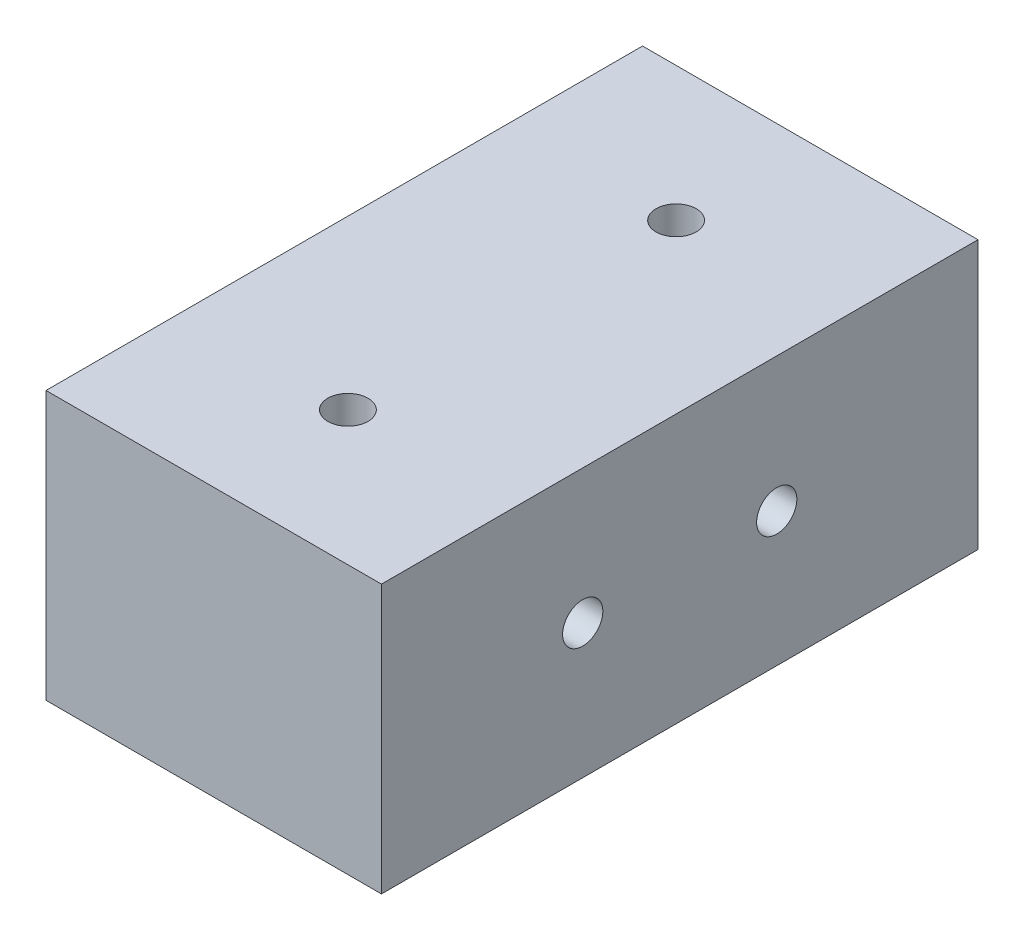
ISO-10303-21;
HEADER;
FILE_DESCRIPTION(('STEP AP214'),'2;1');
FILE_NAME('part.step','',(''),(''),'','','');
FILE_SCHEMA(('AUTOMOTIVE_DESIGN { 1 0 10303 214 1 1 1 1 }'));
ENDSEC;
DATA;
#1=APPLICATION_CONTEXT('core data for automotive mechanical design processes');
#2=APPLICATION_PROTOCOL_DEFINITION('international standard','automotive_design',2000,#1);
#3=PRODUCT_CONTEXT('',#1,'mechanical');
#4=PRODUCT('Part','Part','',(#3));
#5=PRODUCT_RELATED_PRODUCT_CATEGORY('part','',(#4));
#6=PRODUCT_DEFINITION_FORMATION('','',#4);
#7=PRODUCT_DEFINITION_CONTEXT('part definition',#1,'design');
#8=PRODUCT_DEFINITION('design','',#6,#7);
#9=PRODUCT_DEFINITION_SHAPE('','',#8);
#10=(LENGTH_UNIT() NAMED_UNIT(*) SI_UNIT(.MILLI.,.METRE.));
#11=(NAMED_UNIT(*) PLANE_ANGLE_UNIT() SI_UNIT($,.RADIAN.));
#12=(NAMED_UNIT(*) SI_UNIT($,.STERADIAN.) SOLID_ANGLE_UNIT());
#13=UNCERTAINTY_MEASURE_WITH_UNIT(LENGTH_MEASURE(1.E-05),#10,'distance_accuracy_value','');
#14=(GEOMETRIC_REPRESENTATION_CONTEXT(3) GLOBAL_UNCERTAINTY_ASSIGNED_CONTEXT((#13)) GLOBAL_UNIT_ASSIGNED_CONTEXT((#10,
#11,#12)) REPRESENTATION_CONTEXT('',''));
#15=CARTESIAN_POINT('',(0.,0.,0.));
#16=DIRECTION('',(0.,0.,1.));
#17=DIRECTION('',(1.,0.,0.));
#18=AXIS2_PLACEMENT_3D('',#15,#16,#17);
#19=CARTESIAN_POINT('',(25.,-20.,0.));
#20=DIRECTION('',(0.,0.,1.));
#21=DIRECTION('',(1.,0.,0.));
#22=AXIS2_PLACEMENT_3D('',#19,#20,#21);
#23=PLANE('',#22);
#24=DIRECTION('',(0.,1.,0.));
#25=VECTOR('',#24,1.);
#26=CARTESIAN_POINT('',(0.,-20.,0.));
#27=LINE('',#26,#25);
#28=CARTESIAN_POINT('',(0.,-20.,0.));
#29=VERTEX_POINT('',#28);
#30=CARTESIAN_POINT('',(0.,0.,0.));
#31=VERTEX_POINT('',#30);
#32=EDGE_CURVE('E100',#29,#31,#27,.T.);
#33=ORIENTED_EDGE('',*,*,#32,.T.);
#34=DIRECTION('',(-1.,0.,0.));
#35=VECTOR('',#34,1.);
#36=CARTESIAN_POINT('',(25.,0.,0.));
#37=LINE('',#36,#35);
#38=CARTESIAN_POINT('',(25.,0.,0.));
#39=VERTEX_POINT('',#38);
#40=EDGE_CURVE('E11',#39,#31,#37,.T.);
#41=ORIENTED_EDGE('',*,*,#40,.F.);
#42=DIRECTION('',(0.,1.,0.));
#43=VECTOR('',#42,1.);
#44=CARTESIAN_POINT('',(25.,-20.,0.));
#45=LINE('',#44,#43);
#46=CARTESIAN_POINT('',(25.,-20.,0.));
#47=VERTEX_POINT('',#46);
#48=EDGE_CURVE('E87',#47,#39,#45,.T.);
#49=ORIENTED_EDGE('',*,*,#48,.F.);
#50=DIRECTION('',(-1.,0.,0.));
#51=VECTOR('',#50,1.);
#52=CARTESIAN_POINT('',(25.,-20.,0.));
#53=LINE('',#52,#51);
#54=EDGE_CURVE('E96',#47,#29,#53,.T.);
#55=ORIENTED_EDGE('',*,*,#54,.T.);
#56=EDGE_LOOP('',(#33,#41,#49,#55));
#57=FACE_BOUND('',#56,.T.);
#58=ADVANCED_FACE('F34',(#57),#23,.F.);
#59=CARTESIAN_POINT('',(25.,0.,0.));
#60=DIRECTION('',(0.,-1.,0.));
#61=DIRECTION('',(0.,0.,-1.));
#62=AXIS2_PLACEMENT_3D('',#59,#60,#61);
#63=PLANE('',#62);
#64=CARTESIAN_POINT('',(12.5,0.,34.4603207010313));
#65=DIRECTION('',(0.,-1.,0.));
#66=DIRECTION('',(0.,0.,-1.));
#67=AXIS2_PLACEMENT_3D('',#64,#65,#66);
#68=CIRCLE('',#67,1.5);
#69=CARTESIAN_POINT('',(12.5,0.,32.9603207010313));
#70=VERTEX_POINT('',#69);
#71=EDGE_CURVE('E115',#70,#70,#68,.T.);
#72=ORIENTED_EDGE('',*,*,#71,.T.);
#73=EDGE_LOOP('',(#72));
#74=FACE_BOUND('',#73,.T.);
#75=CARTESIAN_POINT('',(12.5,0.,10.));
#76=DIRECTION('',(0.,-1.,0.));
#77=DIRECTION('',(0.,0.,-1.));
#78=AXIS2_PLACEMENT_3D('',#75,#76,#77);
#79=CIRCLE('',#78,1.5);
#80=CARTESIAN_POINT('',(12.5,0.,8.5));
#81=VERTEX_POINT('',#80);
#82=EDGE_CURVE('E103',#81,#81,#79,.T.);
#83=ORIENTED_EDGE('',*,*,#82,.T.);
#84=EDGE_LOOP('',(#83));
#85=FACE_BOUND('',#84,.T.);
#86=DIRECTION('',(0.,0.,1.));
#87=VECTOR('',#86,1.);
#88=CARTESIAN_POINT('',(0.,0.,0.));
#89=LINE('',#88,#87);
#90=CARTESIAN_POINT('',(0.,0.,44.4603207010313));
#91=VERTEX_POINT('',#90);
#92=EDGE_CURVE('E91',#31,#91,#89,.T.);
#93=ORIENTED_EDGE('',*,*,#92,.T.);
#94=DIRECTION('',(-1.,0.,0.));
#95=VECTOR('',#94,1.);
#96=CARTESIAN_POINT('',(25.,0.,44.4603207010313));
#97=LINE('',#96,#95);
#98=CARTESIAN_POINT('',(25.,0.,44.4603207010313));
#99=VERTEX_POINT('',#98);
#100=EDGE_CURVE('E43',#99,#91,#97,.T.);
#101=ORIENTED_EDGE('',*,*,#100,.F.);
#102=DIRECTION('',(0.,0.,1.));
#103=VECTOR('',#102,1.);
#104=CARTESIAN_POINT('',(25.,0.,0.));
#105=LINE('',#104,#103);
#106=EDGE_CURVE('E82',#39,#99,#105,.T.);
#107=ORIENTED_EDGE('',*,*,#106,.F.);
#108=ORIENTED_EDGE('',*,*,#40,.T.);
#109=EDGE_LOOP('',(#93,#101,#107,#108));
#110=FACE_BOUND('',#109,.T.);
#111=ADVANCED_FACE('F90',(#74,#85,#110),#63,.F.);
#112=CARTESIAN_POINT('',(25.,-20.,44.4603207010313));
#113=DIRECTION('',(0.,0.,-1.));
#114=DIRECTION('',(-1.,0.,0.));
#115=AXIS2_PLACEMENT_3D('',#112,#113,#114);
#116=PLANE('',#115);
#117=DIRECTION('',(0.,-1.,0.));
#118=VECTOR('',#117,1.);
#119=CARTESIAN_POINT('',(0.,-20.,44.4603207010313));
#120=LINE('',#119,#118);
#121=CARTESIAN_POINT('',(0.,-20.,44.4603207010313));
#122=VERTEX_POINT('',#121);
#123=EDGE_CURVE('E69',#91,#122,#120,.T.);
#124=ORIENTED_EDGE('',*,*,#123,.T.);
#125=DIRECTION('',(-1.,0.,0.));
#126=VECTOR('',#125,1.);
#127=CARTESIAN_POINT('',(25.,-20.,44.4603207010313));
#128=LINE('',#127,#126);
#129=CARTESIAN_POINT('',(25.,-20.,44.4603207010313));
#130=VERTEX_POINT('',#129);
#131=EDGE_CURVE('E92',#130,#122,#128,.T.);
#132=ORIENTED_EDGE('',*,*,#131,.F.);
#133=DIRECTION('',(0.,-1.,0.));
#134=VECTOR('',#133,1.);
#135=CARTESIAN_POINT('',(25.,-20.,44.4603207010313));
#136=LINE('',#135,#134);
#137=EDGE_CURVE('E85',#99,#130,#136,.T.);
#138=ORIENTED_EDGE('',*,*,#137,.F.);
#139=ORIENTED_EDGE('',*,*,#100,.T.);
#140=EDGE_LOOP('',(#124,#132,#138,#139));
#141=FACE_BOUND('',#140,.T.);
#142=ADVANCED_FACE('F94',(#141),#116,.F.);
#143=CARTESIAN_POINT('',(25.,-20.,0.));
#144=DIRECTION('',(0.,1.,0.));
#145=DIRECTION('',(0.,0.,1.));
#146=AXIS2_PLACEMENT_3D('',#143,#144,#145);
#147=PLANE('',#146);
#148=CARTESIAN_POINT('',(12.5,-20.,34.4603207010313));
#149=DIRECTION('',(0.,-1.,0.));
#150=DIRECTION('',(0.,0.,-1.));
#151=AXIS2_PLACEMENT_3D('',#148,#149,#150);
#152=CIRCLE('',#151,1.5);
#153=CARTESIAN_POINT('',(12.5,-20.,32.9603207010313));
#154=VERTEX_POINT('',#153);
#155=EDGE_CURVE('E110',#154,#154,#152,.T.);
#156=ORIENTED_EDGE('',*,*,#155,.F.);
#157=EDGE_LOOP('',(#156));
#158=FACE_BOUND('',#157,.T.);
#159=CARTESIAN_POINT('',(12.5,-20.,10.));
#160=DIRECTION('',(0.,-1.,0.));
#161=DIRECTION('',(0.,0.,-1.));
#162=AXIS2_PLACEMENT_3D('',#159,#160,#161);
#163=CIRCLE('',#162,1.5);
#164=CARTESIAN_POINT('',(12.5,-20.,8.5));
#165=VERTEX_POINT('',#164);
#166=EDGE_CURVE('E126',#165,#165,#163,.T.);
#167=ORIENTED_EDGE('',*,*,#166,.F.);
#168=EDGE_LOOP('',(#167));
#169=FACE_BOUND('',#168,.T.);
#170=DIRECTION('',(0.,0.,-1.));
#171=VECTOR('',#170,1.);
#172=CARTESIAN_POINT('',(0.,-20.,0.));
#173=LINE('',#172,#171);
#174=EDGE_CURVE('E75',#122,#29,#173,.T.);
#175=ORIENTED_EDGE('',*,*,#174,.T.);
#176=ORIENTED_EDGE('',*,*,#54,.F.);
#177=DIRECTION('',(0.,0.,-1.));
#178=VECTOR('',#177,1.);
#179=CARTESIAN_POINT('',(25.,-20.,0.));
#180=LINE('',#179,#178);
#181=EDGE_CURVE('E52',#130,#47,#180,.T.);
#182=ORIENTED_EDGE('',*,*,#181,.F.);
#183=ORIENTED_EDGE('',*,*,#131,.T.);
#184=EDGE_LOOP('',(#175,#176,#182,#183));
#185=FACE_BOUND('',#184,.T.);
#186=ADVANCED_FACE('F135',(#158,#169,#185),#147,.F.);
#187=CARTESIAN_POINT('',(25.,0.,0.));
#188=DIRECTION('',(1.,0.,0.));
#189=DIRECTION('',(0.,0.,-1.));
#190=AXIS2_PLACEMENT_3D('',#187,#188,#189);
#191=PLANE('',#190);
#192=CARTESIAN_POINT('',(25.,-10.,15.));
#193=DIRECTION('',(1.,0.,0.));
#194=DIRECTION('',(0.,0.,-1.));
#195=AXIS2_PLACEMENT_3D('',#192,#193,#194);
#196=CIRCLE('',#195,1.5);
#197=CARTESIAN_POINT('',(25.,-10.,13.5));
#198=VERTEX_POINT('',#197);
#199=EDGE_CURVE('E122',#198,#198,#196,.T.);
#200=ORIENTED_EDGE('',*,*,#199,.F.);
#201=EDGE_LOOP('',(#200));
#202=FACE_BOUND('',#201,.T.);
#203=CARTESIAN_POINT('',(25.,-10.,29.4603207010313));
#204=DIRECTION('',(1.,0.,0.));
#205=DIRECTION('',(0.,0.,-1.));
#206=AXIS2_PLACEMENT_3D('',#203,#204,#205);
#207=CIRCLE('',#206,1.5);
#208=CARTESIAN_POINT('',(25.,-10.,27.9603207010313));
#209=VERTEX_POINT('',#208);
#210=EDGE_CURVE('E111',#209,#209,#207,.T.);
#211=ORIENTED_EDGE('',*,*,#210,.F.);
#212=EDGE_LOOP('',(#211));
#213=FACE_BOUND('',#212,.T.);
#214=ORIENTED_EDGE('',*,*,#48,.T.);
#215=ORIENTED_EDGE('',*,*,#106,.T.);
#216=ORIENTED_EDGE('',*,*,#137,.T.);
#217=ORIENTED_EDGE('',*,*,#181,.T.);
#218=EDGE_LOOP('',(#214,#215,#216,#217));
#219=FACE_BOUND('',#218,.T.);
#220=ADVANCED_FACE('F83',(#202,#213,#219),#191,.T.);
#221=CARTESIAN_POINT('',(0.,0.,0.));
#222=DIRECTION('',(1.,0.,0.));
#223=DIRECTION('',(0.,0.,-1.));
#224=AXIS2_PLACEMENT_3D('',#221,#222,#223);
#225=PLANE('',#224);
#226=CARTESIAN_POINT('',(0.,-10.,15.));
#227=DIRECTION('',(1.,0.,0.));
#228=DIRECTION('',(0.,0.,-1.));
#229=AXIS2_PLACEMENT_3D('',#226,#227,#228);
#230=CIRCLE('',#229,1.5);
#231=CARTESIAN_POINT('',(0.,-10.,13.5));
#232=VERTEX_POINT('',#231);
#233=EDGE_CURVE('E37',#232,#232,#230,.T.);
#234=ORIENTED_EDGE('',*,*,#233,.T.);
#235=EDGE_LOOP('',(#234));
#236=FACE_BOUND('',#235,.T.);
#237=CARTESIAN_POINT('',(0.,-10.,29.4603207010313));
#238=DIRECTION('',(1.,0.,0.));
#239=DIRECTION('',(0.,0.,-1.));
#240=AXIS2_PLACEMENT_3D('',#237,#238,#239);
#241=CIRCLE('',#240,1.5);
#242=CARTESIAN_POINT('',(0.,-10.,27.9603207010313));
#243=VERTEX_POINT('',#242);
#244=EDGE_CURVE('E108',#243,#243,#241,.T.);
#245=ORIENTED_EDGE('',*,*,#244,.T.);
#246=EDGE_LOOP('',(#245));
#247=FACE_BOUND('',#246,.T.);
#248=ORIENTED_EDGE('',*,*,#32,.F.);
#249=ORIENTED_EDGE('',*,*,#174,.F.);
#250=ORIENTED_EDGE('',*,*,#123,.F.);
#251=ORIENTED_EDGE('',*,*,#92,.F.);
#252=EDGE_LOOP('',(#248,#249,#250,#251));
#253=FACE_BOUND('',#252,.T.);
#254=ADVANCED_FACE('F143',(#236,#247,#253),#225,.F.);
#255=CARTESIAN_POINT('',(12.5,0.,10.));
#256=DIRECTION('',(0.,-1.,0.));
#257=DIRECTION('',(0.,0.,-1.));
#258=AXIS2_PLACEMENT_3D('',#255,#256,#257);
#259=CYLINDRICAL_SURFACE('',#258,1.5);
#260=ORIENTED_EDGE('',*,*,#82,.F.);
#261=EDGE_LOOP('',(#260));
#262=FACE_BOUND('',#261,.T.);
#263=ORIENTED_EDGE('',*,*,#166,.T.);
#264=EDGE_LOOP('',(#263));
#265=FACE_BOUND('',#264,.T.);
#266=ADVANCED_FACE('F133',(#262,#265),#259,.F.);
#267=CARTESIAN_POINT('',(12.5,0.,34.4603207010313));
#268=DIRECTION('',(0.,-1.,0.));
#269=DIRECTION('',(0.,0.,-1.));
#270=AXIS2_PLACEMENT_3D('',#267,#268,#269);
#271=CYLINDRICAL_SURFACE('',#270,1.5);
#272=ORIENTED_EDGE('',*,*,#71,.F.);
#273=EDGE_LOOP('',(#272));
#274=FACE_BOUND('',#273,.T.);
#275=ORIENTED_EDGE('',*,*,#155,.T.);
#276=EDGE_LOOP('',(#275));
#277=FACE_BOUND('',#276,.T.);
#278=ADVANCED_FACE('F162',(#274,#277),#271,.F.);
#279=CARTESIAN_POINT('',(-25.,-10.,29.4603207010313));
#280=DIRECTION('',(1.,0.,0.));
#281=DIRECTION('',(0.,0.,-1.));
#282=AXIS2_PLACEMENT_3D('',#279,#280,#281);
#283=CYLINDRICAL_SURFACE('',#282,1.5);
#284=ORIENTED_EDGE('',*,*,#210,.T.);
#285=EDGE_LOOP('',(#284));
#286=FACE_BOUND('',#285,.T.);
#287=ORIENTED_EDGE('',*,*,#244,.F.);
#288=EDGE_LOOP('',(#287));
#289=FACE_BOUND('',#288,.T.);
#290=ADVANCED_FACE('F168',(#286,#289),#283,.F.);
#291=CARTESIAN_POINT('',(-25.,-10.,15.));
#292=DIRECTION('',(1.,0.,0.));
#293=DIRECTION('',(0.,0.,-1.));
#294=AXIS2_PLACEMENT_3D('',#291,#292,#293);
#295=CYLINDRICAL_SURFACE('',#294,1.5);
#296=ORIENTED_EDGE('',*,*,#199,.T.);
#297=EDGE_LOOP('',(#296));
#298=FACE_BOUND('',#297,.T.);
#299=ORIENTED_EDGE('',*,*,#233,.F.);
#300=EDGE_LOOP('',(#299));
#301=FACE_BOUND('',#300,.T.);
#302=ADVANCED_FACE('F172',(#298,#301),#295,.F.);
#303=CLOSED_SHELL('',(#58,#111,#142,#186,#220,#254,#266,#278,#290,#302));
#304=MANIFOLD_SOLID_BREP('B2',#303);
#305=ADVANCED_BREP_SHAPE_REPRESENTATION('',(#18,#304),#14);
#306=SHAPE_DEFINITION_REPRESENTATION(#9,#305);
ENDSEC;
END-ISO-10303-21;
